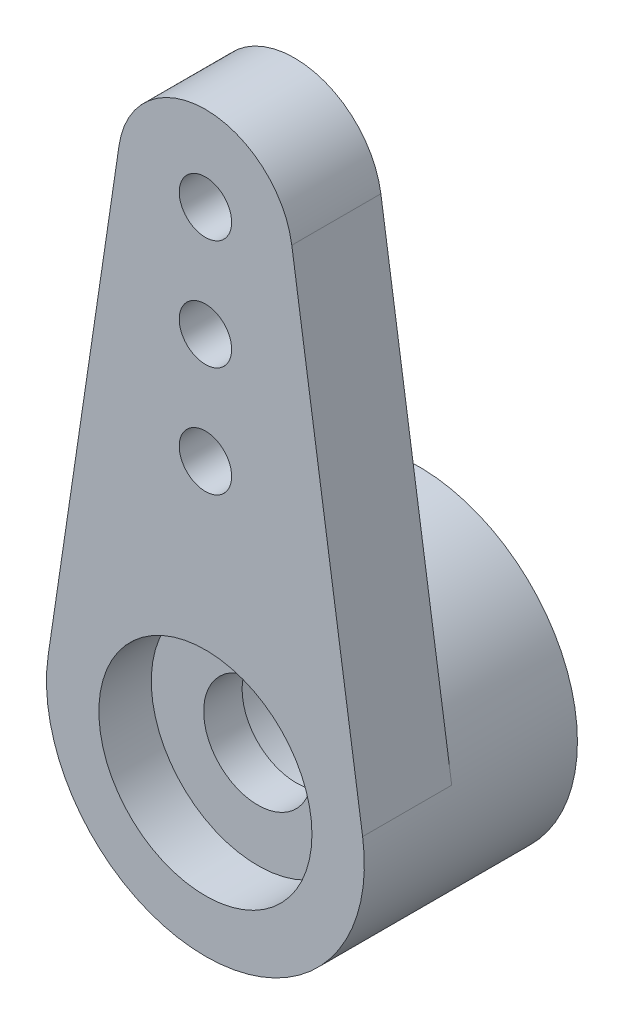
ISO-10303-21;
HEADER;
FILE_DESCRIPTION(('STEP AP214'),'2;1');
FILE_NAME('part.step','',(''),(''),'','','');
FILE_SCHEMA(('AUTOMOTIVE_DESIGN { 1 0 10303 214 1 1 1 1 }'));
ENDSEC;
DATA;
#1=APPLICATION_CONTEXT('core data for automotive mechanical design processes');
#2=APPLICATION_PROTOCOL_DEFINITION('international standard','automotive_design',2000,#1);
#3=PRODUCT_CONTEXT('',#1,'mechanical');
#4=PRODUCT('Part','Part','',(#3));
#5=PRODUCT_RELATED_PRODUCT_CATEGORY('part','',(#4));
#6=PRODUCT_DEFINITION_FORMATION('','',#4);
#7=PRODUCT_DEFINITION_CONTEXT('part definition',#1,'design');
#8=PRODUCT_DEFINITION('design','',#6,#7);
#9=PRODUCT_DEFINITION_SHAPE('','',#8);
#10=(LENGTH_UNIT() NAMED_UNIT(*) SI_UNIT(.MILLI.,.METRE.));
#11=(NAMED_UNIT(*) PLANE_ANGLE_UNIT() SI_UNIT($,.RADIAN.));
#12=(NAMED_UNIT(*) SI_UNIT($,.STERADIAN.) SOLID_ANGLE_UNIT());
#13=UNCERTAINTY_MEASURE_WITH_UNIT(LENGTH_MEASURE(1.E-05),#10,'distance_accuracy_value','');
#14=(GEOMETRIC_REPRESENTATION_CONTEXT(3) GLOBAL_UNCERTAINTY_ASSIGNED_CONTEXT((#13)) GLOBAL_UNIT_ASSIGNED_CONTEXT((#10,
#11,#12)) REPRESENTATION_CONTEXT('',''));
#15=CARTESIAN_POINT('',(0.,0.,0.));
#16=DIRECTION('',(0.,0.,1.));
#17=DIRECTION('',(1.,0.,0.));
#18=AXIS2_PLACEMENT_3D('',#15,#16,#17);
#19=CARTESIAN_POINT('',(0.,0.,1.05));
#20=DIRECTION('',(0.,0.,1.));
#21=DIRECTION('',(1.,0.,0.));
#22=AXIS2_PLACEMENT_3D('',#19,#20,#21);
#23=CYLINDRICAL_SURFACE('',#22,1.55);
#24=CARTESIAN_POINT('',(0.,0.,1.05));
#25=DIRECTION('',(0.,0.,1.));
#26=DIRECTION('',(1.,0.,0.));
#27=AXIS2_PLACEMENT_3D('',#24,#25,#26);
#28=CIRCLE('',#27,1.55);
#29=CARTESIAN_POINT('',(1.55,0.,1.05));
#30=VERTEX_POINT('',#29);
#31=EDGE_CURVE('E148',#30,#30,#28,.T.);
#32=ORIENTED_EDGE('',*,*,#31,.T.);
#33=EDGE_LOOP('',(#32));
#34=FACE_BOUND('',#33,.T.);
#35=CARTESIAN_POINT('',(0.,0.,-0.0499999999999997));
#36=DIRECTION('',(0.,0.,-1.));
#37=DIRECTION('',(-1.,0.,0.));
#38=AXIS2_PLACEMENT_3D('',#35,#36,#37);
#39=CIRCLE('',#38,1.55);
#40=CARTESIAN_POINT('',(-1.55,0.,-0.0499999999999997));
#41=VERTEX_POINT('',#40);
#42=EDGE_CURVE('E49',#41,#41,#39,.F.);
#43=ORIENTED_EDGE('',*,*,#42,.F.);
#44=EDGE_LOOP('',(#43));
#45=FACE_BOUND('',#44,.T.);
#46=ADVANCED_FACE('F45',(#34,#45),#23,.F.);
#47=CARTESIAN_POINT('',(0.,0.,0.));
#48=DIRECTION('',(0.,0.,1.));
#49=DIRECTION('',(1.,0.,0.));
#50=AXIS2_PLACEMENT_3D('',#47,#48,#49);
#51=PLANE('',#50);
#52=CARTESIAN_POINT('',(0.,14.025,0.));
#53=DIRECTION('',(0.,0.,1.));
#54=DIRECTION('',(1.,0.,0.));
#55=AXIS2_PLACEMENT_3D('',#52,#53,#54);
#56=CIRCLE('',#55,0.75);
#57=CARTESIAN_POINT('',(0.749999999999978,14.025,0.));
#58=VERTEX_POINT('',#57);
#59=EDGE_CURVE('E138',#58,#58,#56,.T.);
#60=ORIENTED_EDGE('',*,*,#59,.T.);
#61=EDGE_LOOP('',(#60));
#62=FACE_BOUND('',#61,.T.);
#63=CARTESIAN_POINT('',(0.,10.875,0.));
#64=DIRECTION('',(0.,0.,1.));
#65=DIRECTION('',(1.,0.,0.));
#66=AXIS2_PLACEMENT_3D('',#63,#64,#65);
#67=CIRCLE('',#66,0.75);
#68=CARTESIAN_POINT('',(0.749999999999989,10.875,0.));
#69=VERTEX_POINT('',#68);
#70=EDGE_CURVE('E132',#69,#69,#67,.T.);
#71=ORIENTED_EDGE('',*,*,#70,.T.);
#72=EDGE_LOOP('',(#71));
#73=FACE_BOUND('',#72,.T.);
#74=CARTESIAN_POINT('',(0.,7.725,0.));
#75=DIRECTION('',(0.,0.,1.));
#76=DIRECTION('',(1.,0.,0.));
#77=AXIS2_PLACEMENT_3D('',#74,#75,#76);
#78=CIRCLE('',#77,0.75);
#79=CARTESIAN_POINT('',(0.75,7.725,0.));
#80=VERTEX_POINT('',#79);
#81=EDGE_CURVE('E126',#80,#80,#78,.T.);
#82=ORIENTED_EDGE('',*,*,#81,.T.);
#83=EDGE_LOOP('',(#82));
#84=FACE_BOUND('',#83,.T.);
#85=CARTESIAN_POINT('',(0.,0.,0.));
#86=DIRECTION('',(0.,0.,-1.));
#87=DIRECTION('',(-1.,0.,0.));
#88=AXIS2_PLACEMENT_3D('',#85,#86,#87);
#89=CIRCLE('',#88,4.55);
#90=CARTESIAN_POINT('',(-4.50060254127625,0.66863799283154,0.));
#91=VERTEX_POINT('',#90);
#92=CARTESIAN_POINT('',(4.50060254127625,0.668637992831541,0.));
#93=VERTEX_POINT('',#92);
#94=EDGE_CURVE('E94',#91,#93,#89,.T.);
#95=ORIENTED_EDGE('',*,*,#94,.F.);
#96=DIRECTION('',(-0.146953405017921,-0.989143415665109,0.));
#97=VECTOR('',#96,1.);
#98=CARTESIAN_POINT('',(-4.50060254127625,0.66863799283154,0.));
#99=LINE('',#98,#97);
#100=CARTESIAN_POINT('',(-2.47285853916277,14.3173835125448,0.));
#101=VERTEX_POINT('',#100);
#102=EDGE_CURVE('E97',#101,#91,#99,.T.);
#103=ORIENTED_EDGE('',*,*,#102,.F.);
#104=CARTESIAN_POINT('',(0.,13.95,0.));
#105=DIRECTION('',(0.,0.,1.));
#106=DIRECTION('',(-1.,0.,0.));
#107=AXIS2_PLACEMENT_3D('',#104,#105,#106);
#108=CIRCLE('',#107,2.5);
#109=CARTESIAN_POINT('',(2.47285853916277,14.3173835125448,0.));
#110=VERTEX_POINT('',#109);
#111=EDGE_CURVE('E84',#110,#101,#108,.T.);
#112=ORIENTED_EDGE('',*,*,#111,.F.);
#113=DIRECTION('',(-0.146953405017921,0.989143415665109,0.));
#114=VECTOR('',#113,1.);
#115=CARTESIAN_POINT('',(4.50060254127625,0.668637992831541,0.));
#116=LINE('',#115,#114);
#117=EDGE_CURVE('E77',#93,#110,#116,.T.);
#118=ORIENTED_EDGE('',*,*,#117,.F.);
#119=EDGE_LOOP('',(#95,#103,#112,#118));
#120=FACE_BOUND('',#119,.T.);
#121=ADVANCED_FACE('F96',(#62,#73,#84,#120),#51,.F.);
#122=CARTESIAN_POINT('',(0.,0.,2.55));
#123=DIRECTION('',(0.,0.,1.));
#124=DIRECTION('',(1.,0.,0.));
#125=AXIS2_PLACEMENT_3D('',#122,#123,#124);
#126=PLANE('',#125);
#127=CARTESIAN_POINT('',(0.,0.,2.55));
#128=DIRECTION('',(0.,0.,1.));
#129=DIRECTION('',(1.,0.,0.));
#130=AXIS2_PLACEMENT_3D('',#127,#128,#129);
#131=CIRCLE('',#130,3.05);
#132=CARTESIAN_POINT('',(3.05,0.,2.55));
#133=VERTEX_POINT('',#132);
#134=EDGE_CURVE('E145',#133,#133,#131,.T.);
#135=ORIENTED_EDGE('',*,*,#134,.F.);
#136=EDGE_LOOP('',(#135));
#137=FACE_BOUND('',#136,.T.);
#138=CARTESIAN_POINT('',(0.,10.875,2.55));
#139=DIRECTION('',(0.,0.,1.));
#140=DIRECTION('',(1.,0.,0.));
#141=AXIS2_PLACEMENT_3D('',#138,#139,#140);
#142=CIRCLE('',#141,0.75);
#143=CARTESIAN_POINT('',(0.749999999999989,10.875,2.55));
#144=VERTEX_POINT('',#143);
#145=EDGE_CURVE('E129',#144,#144,#142,.T.);
#146=ORIENTED_EDGE('',*,*,#145,.F.);
#147=EDGE_LOOP('',(#146));
#148=FACE_BOUND('',#147,.T.);
#149=CARTESIAN_POINT('',(0.,0.,2.55));
#150=DIRECTION('',(0.,0.,1.));
#151=DIRECTION('',(1.,0.,0.));
#152=AXIS2_PLACEMENT_3D('',#149,#150,#151);
#153=CIRCLE('',#152,4.55);
#154=CARTESIAN_POINT('',(-4.50060254127625,0.66863799283154,2.55));
#155=VERTEX_POINT('',#154);
#156=CARTESIAN_POINT('',(4.50060254127625,0.668637992831541,2.55));
#157=VERTEX_POINT('',#156);
#158=EDGE_CURVE('E109',#155,#157,#153,.T.);
#159=ORIENTED_EDGE('',*,*,#158,.T.);
#160=DIRECTION('',(-0.146953405017921,0.989143415665109,0.));
#161=VECTOR('',#160,1.);
#162=CARTESIAN_POINT('',(4.50060254127625,0.668637992831541,2.55));
#163=LINE('',#162,#161);
#164=CARTESIAN_POINT('',(2.47285853916277,14.3173835125448,2.55));
#165=VERTEX_POINT('',#164);
#166=EDGE_CURVE('E89',#157,#165,#163,.T.);
#167=ORIENTED_EDGE('',*,*,#166,.T.);
#168=CARTESIAN_POINT('',(0.,13.95,2.55));
#169=DIRECTION('',(0.,0.,1.));
#170=DIRECTION('',(-1.,0.,0.));
#171=AXIS2_PLACEMENT_3D('',#168,#169,#170);
#172=CIRCLE('',#171,2.5);
#173=CARTESIAN_POINT('',(-2.47285853916277,14.3173835125448,2.55));
#174=VERTEX_POINT('',#173);
#175=EDGE_CURVE('E114',#165,#174,#172,.T.);
#176=ORIENTED_EDGE('',*,*,#175,.T.);
#177=DIRECTION('',(-0.146953405017921,-0.989143415665109,0.));
#178=VECTOR('',#177,1.);
#179=CARTESIAN_POINT('',(-4.50060254127625,0.66863799283154,2.55));
#180=LINE('',#179,#178);
#181=EDGE_CURVE('E63',#174,#155,#180,.T.);
#182=ORIENTED_EDGE('',*,*,#181,.T.);
#183=EDGE_LOOP('',(#159,#167,#176,#182));
#184=FACE_BOUND('',#183,.T.);
#185=CARTESIAN_POINT('',(0.,7.725,2.55));
#186=DIRECTION('',(0.,0.,1.));
#187=DIRECTION('',(1.,0.,0.));
#188=AXIS2_PLACEMENT_3D('',#185,#186,#187);
#189=CIRCLE('',#188,0.75);
#190=CARTESIAN_POINT('',(0.75,7.725,2.55));
#191=VERTEX_POINT('',#190);
#192=EDGE_CURVE('E120',#191,#191,#189,.T.);
#193=ORIENTED_EDGE('',*,*,#192,.F.);
#194=EDGE_LOOP('',(#193));
#195=FACE_BOUND('',#194,.T.);
#196=CARTESIAN_POINT('',(0.,14.025,2.55));
#197=DIRECTION('',(0.,0.,1.));
#198=DIRECTION('',(1.,0.,0.));
#199=AXIS2_PLACEMENT_3D('',#196,#197,#198);
#200=CIRCLE('',#199,0.75);
#201=CARTESIAN_POINT('',(0.749999999999978,14.025,2.55));
#202=VERTEX_POINT('',#201);
#203=EDGE_CURVE('E135',#202,#202,#200,.T.);
#204=ORIENTED_EDGE('',*,*,#203,.F.);
#205=EDGE_LOOP('',(#204));
#206=FACE_BOUND('',#205,.T.);
#207=ADVANCED_FACE('F173',(#137,#148,#184,#195,#206),#126,.T.);
#208=CARTESIAN_POINT('',(0.,0.,2.55));
#209=DIRECTION('',(0.,0.,-1.));
#210=DIRECTION('',(-1.,0.,0.));
#211=AXIS2_PLACEMENT_3D('',#208,#209,#210);
#212=CYLINDRICAL_SURFACE('',#211,4.55);
#213=DIRECTION('',(0.,0.,-1.));
#214=VECTOR('',#213,1.);
#215=CARTESIAN_POINT('',(-4.50060254127625,0.66863799283154,2.55));
#216=LINE('',#215,#214);
#217=EDGE_CURVE('E106',#155,#91,#216,.T.);
#218=ORIENTED_EDGE('',*,*,#217,.T.);
#219=ORIENTED_EDGE('',*,*,#94,.T.);
#220=DIRECTION('',(0.,0.,-1.));
#221=VECTOR('',#220,1.);
#222=CARTESIAN_POINT('',(4.50060254127625,0.668637992831541,2.55));
#223=LINE('',#222,#221);
#224=EDGE_CURVE('E12',#157,#93,#223,.T.);
#225=ORIENTED_EDGE('',*,*,#224,.F.);
#226=ORIENTED_EDGE('',*,*,#158,.F.);
#227=EDGE_LOOP('',(#218,#219,#225,#226));
#228=FACE_BOUND('',#227,.T.);
#229=CARTESIAN_POINT('',(0.,0.,-3.55));
#230=DIRECTION('',(0.,0.,1.));
#231=DIRECTION('',(1.,0.,0.));
#232=AXIS2_PLACEMENT_3D('',#229,#230,#231);
#233=CIRCLE('',#232,4.55);
#234=CARTESIAN_POINT('',(4.55,0.,-3.55));
#235=VERTEX_POINT('',#234);
#236=EDGE_CURVE('E101',#235,#235,#233,.T.);
#237=ORIENTED_EDGE('',*,*,#236,.T.);
#238=EDGE_LOOP('',(#237));
#239=FACE_BOUND('',#238,.T.);
#240=ADVANCED_FACE('F47',(#228,#239),#212,.T.);
#241=CARTESIAN_POINT('',(4.50060254127625,0.668637992831541,2.55));
#242=DIRECTION('',(-0.989143415665109,-0.146953405017921,0.));
#243=DIRECTION('',(0.146953405017921,-0.989143415665109,0.));
#244=AXIS2_PLACEMENT_3D('',#241,#242,#243);
#245=PLANE('',#244);
#246=ORIENTED_EDGE('',*,*,#117,.T.);
#247=DIRECTION('',(0.,0.,-1.));
#248=VECTOR('',#247,1.);
#249=CARTESIAN_POINT('',(2.47285853916277,14.3173835125448,2.55));
#250=LINE('',#249,#248);
#251=EDGE_CURVE('E55',#165,#110,#250,.T.);
#252=ORIENTED_EDGE('',*,*,#251,.F.);
#253=ORIENTED_EDGE('',*,*,#166,.F.);
#254=ORIENTED_EDGE('',*,*,#224,.T.);
#255=EDGE_LOOP('',(#246,#252,#253,#254));
#256=FACE_BOUND('',#255,.T.);
#257=ADVANCED_FACE('F208',(#256),#245,.F.);
#258=CARTESIAN_POINT('',(0.,13.95,2.55));
#259=DIRECTION('',(0.,0.,-1.));
#260=DIRECTION('',(-1.,0.,0.));
#261=AXIS2_PLACEMENT_3D('',#258,#259,#260);
#262=CYLINDRICAL_SURFACE('',#261,2.5);
#263=ORIENTED_EDGE('',*,*,#111,.T.);
#264=DIRECTION('',(0.,0.,-1.));
#265=VECTOR('',#264,1.);
#266=CARTESIAN_POINT('',(-2.47285853916277,14.3173835125448,2.55));
#267=LINE('',#266,#265);
#268=EDGE_CURVE('E108',#174,#101,#267,.T.);
#269=ORIENTED_EDGE('',*,*,#268,.F.);
#270=ORIENTED_EDGE('',*,*,#175,.F.);
#271=ORIENTED_EDGE('',*,*,#251,.T.);
#272=EDGE_LOOP('',(#263,#269,#270,#271));
#273=FACE_BOUND('',#272,.T.);
#274=ADVANCED_FACE('F119',(#273),#262,.T.);
#275=CARTESIAN_POINT('',(-4.50060254127625,0.66863799283154,2.55));
#276=DIRECTION('',(0.989143415665109,-0.146953405017921,0.));
#277=DIRECTION('',(0.146953405017921,0.989143415665109,0.));
#278=AXIS2_PLACEMENT_3D('',#275,#276,#277);
#279=PLANE('',#278);
#280=ORIENTED_EDGE('',*,*,#102,.T.);
#281=ORIENTED_EDGE('',*,*,#217,.F.);
#282=ORIENTED_EDGE('',*,*,#181,.F.);
#283=ORIENTED_EDGE('',*,*,#268,.T.);
#284=EDGE_LOOP('',(#280,#281,#282,#283));
#285=FACE_BOUND('',#284,.T.);
#286=ADVANCED_FACE('F105',(#285),#279,.F.);
#287=CARTESIAN_POINT('',(0.,7.725,2.55));
#288=DIRECTION('',(0.,0.,-1.));
#289=DIRECTION('',(-1.,0.,0.));
#290=AXIS2_PLACEMENT_3D('',#287,#288,#289);
#291=CYLINDRICAL_SURFACE('',#290,0.75);
#292=ORIENTED_EDGE('',*,*,#192,.T.);
#293=EDGE_LOOP('',(#292));
#294=FACE_BOUND('',#293,.T.);
#295=ORIENTED_EDGE('',*,*,#81,.F.);
#296=EDGE_LOOP('',(#295));
#297=FACE_BOUND('',#296,.T.);
#298=ADVANCED_FACE('F197',(#294,#297),#291,.F.);
#299=CARTESIAN_POINT('',(0.,10.875,2.55));
#300=DIRECTION('',(0.,0.,-1.));
#301=DIRECTION('',(-1.,0.,0.));
#302=AXIS2_PLACEMENT_3D('',#299,#300,#301);
#303=CYLINDRICAL_SURFACE('',#302,0.75);
#304=ORIENTED_EDGE('',*,*,#145,.T.);
#305=EDGE_LOOP('',(#304));
#306=FACE_BOUND('',#305,.T.);
#307=ORIENTED_EDGE('',*,*,#70,.F.);
#308=EDGE_LOOP('',(#307));
#309=FACE_BOUND('',#308,.T.);
#310=ADVANCED_FACE('F193',(#306,#309),#303,.F.);
#311=CARTESIAN_POINT('',(0.,14.025,2.55));
#312=DIRECTION('',(0.,0.,-1.));
#313=DIRECTION('',(-1.,0.,0.));
#314=AXIS2_PLACEMENT_3D('',#311,#312,#313);
#315=CYLINDRICAL_SURFACE('',#314,0.75);
#316=ORIENTED_EDGE('',*,*,#203,.T.);
#317=EDGE_LOOP('',(#316));
#318=FACE_BOUND('',#317,.T.);
#319=ORIENTED_EDGE('',*,*,#59,.F.);
#320=EDGE_LOOP('',(#319));
#321=FACE_BOUND('',#320,.T.);
#322=ADVANCED_FACE('F189',(#318,#321),#315,.F.);
#323=CARTESIAN_POINT('',(0.,0.,-3.55));
#324=DIRECTION('',(0.,0.,1.));
#325=DIRECTION('',(1.,0.,0.));
#326=AXIS2_PLACEMENT_3D('',#323,#324,#325);
#327=PLANE('',#326);
#328=CARTESIAN_POINT('',(0.,0.,-3.55));
#329=DIRECTION('',(0.,0.,-1.));
#330=DIRECTION('',(-1.,0.,0.));
#331=AXIS2_PLACEMENT_3D('',#328,#329,#330);
#332=CIRCLE('',#331,2.75);
#333=CARTESIAN_POINT('',(-2.75,0.,-3.55));
#334=VERTEX_POINT('',#333);
#335=EDGE_CURVE('E153',#334,#334,#332,.T.);
#336=ORIENTED_EDGE('',*,*,#335,.F.);
#337=EDGE_LOOP('',(#336));
#338=FACE_BOUND('',#337,.T.);
#339=ORIENTED_EDGE('',*,*,#236,.F.);
#340=EDGE_LOOP('',(#339));
#341=FACE_BOUND('',#340,.T.);
#342=ADVANCED_FACE('F186',(#338,#341),#327,.F.);
#343=CARTESIAN_POINT('',(0.,0.,1.05));
#344=DIRECTION('',(0.,0.,1.));
#345=DIRECTION('',(1.,0.,0.));
#346=AXIS2_PLACEMENT_3D('',#343,#344,#345);
#347=CYLINDRICAL_SURFACE('',#346,3.05);
#348=CARTESIAN_POINT('',(0.,0.,1.05));
#349=DIRECTION('',(0.,0.,1.));
#350=DIRECTION('',(1.,0.,0.));
#351=AXIS2_PLACEMENT_3D('',#348,#349,#350);
#352=CIRCLE('',#351,3.05);
#353=CARTESIAN_POINT('',(3.05,0.,1.05));
#354=VERTEX_POINT('',#353);
#355=EDGE_CURVE('E102',#354,#354,#352,.T.);
#356=ORIENTED_EDGE('',*,*,#355,.F.);
#357=EDGE_LOOP('',(#356));
#358=FACE_BOUND('',#357,.T.);
#359=ORIENTED_EDGE('',*,*,#134,.T.);
#360=EDGE_LOOP('',(#359));
#361=FACE_BOUND('',#360,.T.);
#362=ADVANCED_FACE('F182',(#358,#361),#347,.F.);
#363=CARTESIAN_POINT('',(0.,0.,1.05));
#364=DIRECTION('',(0.,0.,1.));
#365=DIRECTION('',(1.,0.,0.));
#366=AXIS2_PLACEMENT_3D('',#363,#364,#365);
#367=PLANE('',#366);
#368=ORIENTED_EDGE('',*,*,#31,.F.);
#369=EDGE_LOOP('',(#368));
#370=FACE_BOUND('',#369,.T.);
#371=ORIENTED_EDGE('',*,*,#355,.T.);
#372=EDGE_LOOP('',(#371));
#373=FACE_BOUND('',#372,.T.);
#374=ADVANCED_FACE('F180',(#370,#373),#367,.T.);
#375=CARTESIAN_POINT('',(0.,0.,-0.0499999999999997));
#376=DIRECTION('',(0.,0.,-1.));
#377=DIRECTION('',(-1.,0.,0.));
#378=AXIS2_PLACEMENT_3D('',#375,#376,#377);
#379=PLANE('',#378);
#380=CARTESIAN_POINT('',(0.,0.,-0.0499999999999997));
#381=DIRECTION('',(0.,0.,-1.));
#382=DIRECTION('',(-1.,0.,0.));
#383=AXIS2_PLACEMENT_3D('',#380,#381,#382);
#384=CIRCLE('',#383,2.75);
#385=CARTESIAN_POINT('',(-2.75,0.,-0.0499999999999997));
#386=VERTEX_POINT('',#385);
#387=EDGE_CURVE('E156',#386,#386,#384,.T.);
#388=ORIENTED_EDGE('',*,*,#387,.T.);
#389=EDGE_LOOP('',(#388));
#390=FACE_BOUND('',#389,.T.);
#391=ORIENTED_EDGE('',*,*,#42,.T.);
#392=EDGE_LOOP('',(#391));
#393=FACE_BOUND('',#392,.T.);
#394=ADVANCED_FACE('F163',(#390,#393),#379,.T.);
#395=CARTESIAN_POINT('',(0.,0.,-0.0499999999999997));
#396=DIRECTION('',(0.,0.,-1.));
#397=DIRECTION('',(-1.,0.,0.));
#398=AXIS2_PLACEMENT_3D('',#395,#396,#397);
#399=CYLINDRICAL_SURFACE('',#398,2.75);
#400=ORIENTED_EDGE('',*,*,#387,.F.);
#401=EDGE_LOOP('',(#400));
#402=FACE_BOUND('',#401,.T.);
#403=ORIENTED_EDGE('',*,*,#335,.T.);
#404=EDGE_LOOP('',(#403));
#405=FACE_BOUND('',#404,.T.);
#406=ADVANCED_FACE('F178',(#402,#405),#399,.F.);
#407=CLOSED_SHELL('',(#46,#121,#207,#240,#257,#274,#286,#298,#310,#322,#342,#362,#374,#394,#406));
#408=MANIFOLD_SOLID_BREP('B2',#407);
#409=ADVANCED_BREP_SHAPE_REPRESENTATION('',(#18,#408),#14);
#410=SHAPE_DEFINITION_REPRESENTATION(#9,#409);
ENDSEC;
END-ISO-10303-21;
